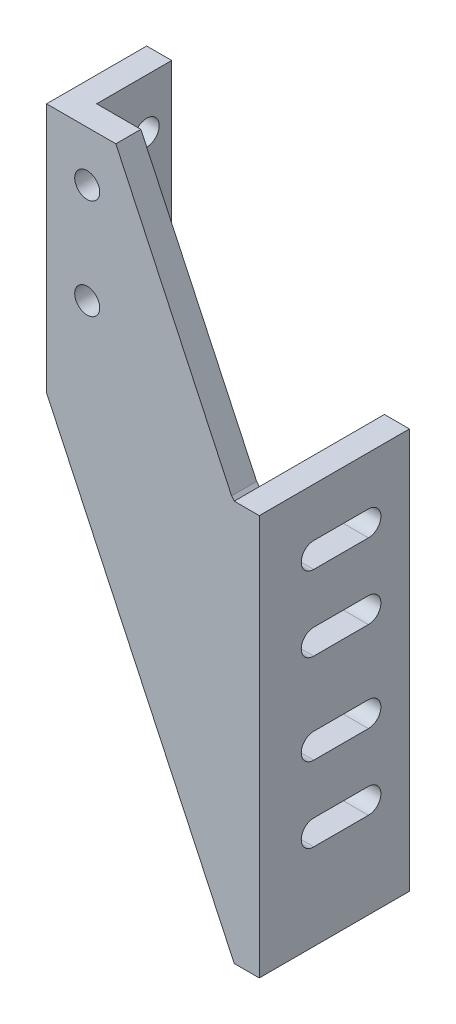
ISO-10303-21;
HEADER;
FILE_DESCRIPTION(('STEP AP214'),'2;1');
FILE_NAME('part.step','',(''),(''),'','','');
FILE_SCHEMA(('AUTOMOTIVE_DESIGN { 1 0 10303 214 1 1 1 1 }'));
ENDSEC;
DATA;
#1=APPLICATION_CONTEXT('core data for automotive mechanical design processes');
#2=APPLICATION_PROTOCOL_DEFINITION('international standard','automotive_design',2000,#1);
#3=PRODUCT_CONTEXT('',#1,'mechanical');
#4=PRODUCT('Part','Part','',(#3));
#5=PRODUCT_RELATED_PRODUCT_CATEGORY('part','',(#4));
#6=PRODUCT_DEFINITION_FORMATION('','',#4);
#7=PRODUCT_DEFINITION_CONTEXT('part definition',#1,'design');
#8=PRODUCT_DEFINITION('design','',#6,#7);
#9=PRODUCT_DEFINITION_SHAPE('','',#8);
#10=(LENGTH_UNIT() NAMED_UNIT(*) SI_UNIT(.MILLI.,.METRE.));
#11=(NAMED_UNIT(*) PLANE_ANGLE_UNIT() SI_UNIT($,.RADIAN.));
#12=(NAMED_UNIT(*) SI_UNIT($,.STERADIAN.) SOLID_ANGLE_UNIT());
#13=UNCERTAINTY_MEASURE_WITH_UNIT(LENGTH_MEASURE(1.E-05),#10,'distance_accuracy_value','');
#14=(GEOMETRIC_REPRESENTATION_CONTEXT(3) GLOBAL_UNCERTAINTY_ASSIGNED_CONTEXT((#13)) GLOBAL_UNIT_ASSIGNED_CONTEXT((#10,
#11,#12)) REPRESENTATION_CONTEXT('',''));
#15=CARTESIAN_POINT('',(0.,0.,0.));
#16=DIRECTION('',(0.,0.,1.));
#17=DIRECTION('',(1.,0.,0.));
#18=AXIS2_PLACEMENT_3D('',#15,#16,#17);
#19=CARTESIAN_POINT('',(-106.588300915185,-1.66039880784868,12.7));
#20=DIRECTION('',(0.,0.,1.));
#21=DIRECTION('',(1.,0.,0.));
#22=AXIS2_PLACEMENT_3D('',#19,#20,#21);
#23=PLANE('',#22);
#24=CARTESIAN_POINT('',(-85.963500915185,49.1476380283201,12.7));
#25=DIRECTION('',(0.,0.,-1.));
#26=DIRECTION('',(-1.,0.,0.));
#27=AXIS2_PLACEMENT_3D('',#24,#25,#26);
#28=CIRCLE('',#27,6.34999999999999);
#29=CARTESIAN_POINT('',(-92.313500915185,49.1476380283201,12.7));
#30=VERTEX_POINT('',#29);
#31=EDGE_CURVE('E364',#30,#30,#28,.T.);
#32=ORIENTED_EDGE('',*,*,#31,.T.);
#33=EDGE_LOOP('',(#32));
#34=FACE_BOUND('',#33,.T.);
#35=DIRECTION('',(-1.,0.,0.));
#36=VECTOR('',#35,1.);
#37=CARTESIAN_POINT('',(1.34455174017202,-1.66039880784868,12.7));
#38=LINE('',#37,#36);
#39=CARTESIAN_POINT('',(1.34455174017202,-1.66039880784868,12.7));
#40=VERTEX_POINT('',#39);
#41=CARTESIAN_POINT('',(-11.355448259828,-1.66039880784869,12.7));
#42=VERTEX_POINT('',#41);
#43=EDGE_CURVE('E433',#40,#42,#38,.T.);
#44=ORIENTED_EDGE('',*,*,#43,.T.);
#45=DIRECTION('',(-0.62931680009807,0.77714886933864,0.));
#46=VECTOR('',#45,1.);
#47=CARTESIAN_POINT('',(-11.355448259828,-1.66039880784869,12.7));
#48=LINE('',#47,#46);
#49=CARTESIAN_POINT('',(-12.7,0.,12.7));
#50=VERTEX_POINT('',#49);
#51=EDGE_CURVE('E436',#42,#50,#48,.T.);
#52=ORIENTED_EDGE('',*,*,#51,.T.);
#53=DIRECTION('',(-0.424357467855125,0.905494748452793,0.));
#54=VECTOR('',#53,1.);
#55=CARTESIAN_POINT('',(-12.7,0.,12.7));
#56=LINE('',#55,#54);
#57=CARTESIAN_POINT('',(-71.443804275185,125.34763802832,12.7));
#58=VERTEX_POINT('',#57);
#59=EDGE_CURVE('E439',#50,#58,#56,.T.);
#60=ORIENTED_EDGE('',*,*,#59,.T.);
#61=DIRECTION('',(-1.,0.,0.));
#62=VECTOR('',#61,1.);
#63=CARTESIAN_POINT('',(-71.443804275185,125.34763802832,12.7));
#64=LINE('',#63,#62);
#65=CARTESIAN_POINT('',(-106.588300915185,125.34763802832,12.7));
#66=VERTEX_POINT('',#65);
#67=EDGE_CURVE('E441',#58,#66,#64,.T.);
#68=ORIENTED_EDGE('',*,*,#67,.T.);
#69=DIRECTION('',(0.,-1.,0.));
#70=VECTOR('',#69,1.);
#71=CARTESIAN_POINT('',(-106.588300915185,125.34763802832,12.7));
#72=LINE('',#71,#70);
#73=CARTESIAN_POINT('',(-106.588300915185,-1.65236197167989,12.7));
#74=VERTEX_POINT('',#73);
#75=EDGE_CURVE('E443',#66,#74,#72,.T.);
#76=ORIENTED_EDGE('',*,*,#75,.T.);
#77=DIRECTION('',(0.424357467855112,-0.905494748452799,0.));
#78=VECTOR('',#77,1.);
#79=CARTESIAN_POINT('',(-106.588300915185,-1.65236197167989,12.7));
#80=LINE('',#79,#78);
#81=CARTESIAN_POINT('',(-11.355448259828,-204.860398807849,12.7));
#82=VERTEX_POINT('',#81);
#83=EDGE_CURVE('E445',#74,#82,#80,.T.);
#84=ORIENTED_EDGE('',*,*,#83,.T.);
#85=DIRECTION('',(1.,0.,0.));
#86=VECTOR('',#85,1.);
#87=CARTESIAN_POINT('',(-11.355448259828,-204.860398807849,12.7));
#88=LINE('',#87,#86);
#89=CARTESIAN_POINT('',(1.34455174017202,-204.860398807849,12.7));
#90=VERTEX_POINT('',#89);
#91=EDGE_CURVE('E447',#82,#90,#88,.T.);
#92=ORIENTED_EDGE('',*,*,#91,.T.);
#93=DIRECTION('',(0.,1.,0.));
#94=VECTOR('',#93,1.);
#95=CARTESIAN_POINT('',(1.34455174017202,-204.860398807849,12.7));
#96=LINE('',#95,#94);
#97=EDGE_CURVE('E449',#90,#40,#96,.T.);
#98=ORIENTED_EDGE('',*,*,#97,.T.);
#99=EDGE_LOOP('',(#44,#52,#60,#68,#76,#84,#92,#98));
#100=FACE_BOUND('',#99,.T.);
#101=CARTESIAN_POINT('',(-85.963500915185,99.9476380283201,12.7));
#102=DIRECTION('',(0.,0.,-1.));
#103=DIRECTION('',(-1.,0.,0.));
#104=AXIS2_PLACEMENT_3D('',#101,#102,#103);
#105=CIRCLE('',#104,6.34999999999999);
#106=CARTESIAN_POINT('',(-92.313500915185,99.9476380283201,12.7));
#107=VERTEX_POINT('',#106);
#108=EDGE_CURVE('E358',#107,#107,#105,.T.);
#109=ORIENTED_EDGE('',*,*,#108,.T.);
#110=EDGE_LOOP('',(#109));
#111=FACE_BOUND('',#110,.T.);
#112=ADVANCED_FACE('F44',(#34,#100,#111),#23,.T.);
#113=CARTESIAN_POINT('',(-106.588300915185,-1.66039880784868,0.));
#114=DIRECTION('',(0.,0.,1.));
#115=DIRECTION('',(1.,0.,0.));
#116=AXIS2_PLACEMENT_3D('',#113,#114,#115);
#117=PLANE('',#116);
#118=CARTESIAN_POINT('',(-85.963500915185,49.1476380283201,0.));
#119=DIRECTION('',(0.,0.,-1.));
#120=DIRECTION('',(-1.,0.,0.));
#121=AXIS2_PLACEMENT_3D('',#118,#119,#120);
#122=CIRCLE('',#121,6.34999999999999);
#123=CARTESIAN_POINT('',(-92.313500915185,49.1476380283201,0.));
#124=VERTEX_POINT('',#123);
#125=EDGE_CURVE('E367',#124,#124,#122,.T.);
#126=ORIENTED_EDGE('',*,*,#125,.F.);
#127=EDGE_LOOP('',(#126));
#128=FACE_BOUND('',#127,.T.);
#129=DIRECTION('',(-0.62931680009807,0.77714886933864,0.));
#130=VECTOR('',#129,1.);
#131=CARTESIAN_POINT('',(-11.355448259828,-1.66039880784869,0.));
#132=LINE('',#131,#130);
#133=CARTESIAN_POINT('',(-11.355448259828,-1.66039880784869,0.));
#134=VERTEX_POINT('',#133);
#135=CARTESIAN_POINT('',(-12.7,0.,0.));
#136=VERTEX_POINT('',#135);
#137=EDGE_CURVE('E423',#134,#136,#132,.T.);
#138=ORIENTED_EDGE('',*,*,#137,.F.);
#139=DIRECTION('',(0.,-1.,0.));
#140=VECTOR('',#139,1.);
#141=CARTESIAN_POINT('',(-11.355448259828,-204.860398807849,0.));
#142=LINE('',#141,#140);
#143=CARTESIAN_POINT('',(-11.355448259828,-204.860398807849,0.));
#144=VERTEX_POINT('',#143);
#145=EDGE_CURVE('E376',#134,#144,#142,.T.);
#146=ORIENTED_EDGE('',*,*,#145,.T.);
#147=DIRECTION('',(0.424357467855112,-0.905494748452799,0.));
#148=VECTOR('',#147,1.);
#149=CARTESIAN_POINT('',(-106.588300915185,-1.65236197167989,0.));
#150=LINE('',#149,#148);
#151=CARTESIAN_POINT('',(-106.588300915185,-1.65236197167989,0.));
#152=VERTEX_POINT('',#151);
#153=EDGE_CURVE('E437',#152,#144,#150,.T.);
#154=ORIENTED_EDGE('',*,*,#153,.F.);
#155=DIRECTION('',(1.,0.,0.));
#156=VECTOR('',#155,1.);
#157=CARTESIAN_POINT('',(-106.588300915185,-1.65236197167989,0.));
#158=LINE('',#157,#156);
#159=CARTESIAN_POINT('',(-93.888300915185,-1.65236197167989,0.));
#160=VERTEX_POINT('',#159);
#161=EDGE_CURVE('E394',#152,#160,#158,.T.);
#162=ORIENTED_EDGE('',*,*,#161,.T.);
#163=DIRECTION('',(0.,1.,0.));
#164=VECTOR('',#163,1.);
#165=CARTESIAN_POINT('',(-93.888300915185,125.34763802832,0.));
#166=LINE('',#165,#164);
#167=CARTESIAN_POINT('',(-93.888300915185,125.34763802832,0.));
#168=VERTEX_POINT('',#167);
#169=EDGE_CURVE('E401',#160,#168,#166,.T.);
#170=ORIENTED_EDGE('',*,*,#169,.T.);
#171=DIRECTION('',(-1.,0.,0.));
#172=VECTOR('',#171,1.);
#173=CARTESIAN_POINT('',(-71.443804275185,125.34763802832,0.));
#174=LINE('',#173,#172);
#175=CARTESIAN_POINT('',(-71.443804275185,125.34763802832,0.));
#176=VERTEX_POINT('',#175);
#177=EDGE_CURVE('E420',#176,#168,#174,.T.);
#178=ORIENTED_EDGE('',*,*,#177,.F.);
#179=DIRECTION('',(-0.424357467855125,0.905494748452793,0.));
#180=VECTOR('',#179,1.);
#181=CARTESIAN_POINT('',(-12.7,0.,0.));
#182=LINE('',#181,#180);
#183=EDGE_CURVE('E426',#136,#176,#182,.T.);
#184=ORIENTED_EDGE('',*,*,#183,.F.);
#185=EDGE_LOOP('',(#138,#146,#154,#162,#170,#178,#184));
#186=FACE_BOUND('',#185,.T.);
#187=CARTESIAN_POINT('',(-85.963500915185,99.9476380283201,0.));
#188=DIRECTION('',(0.,0.,-1.));
#189=DIRECTION('',(-1.,0.,0.));
#190=AXIS2_PLACEMENT_3D('',#187,#188,#189);
#191=CIRCLE('',#190,6.34999999999999);
#192=CARTESIAN_POINT('',(-92.313500915185,99.9476380283201,0.));
#193=VERTEX_POINT('',#192);
#194=EDGE_CURVE('E361',#193,#193,#191,.T.);
#195=ORIENTED_EDGE('',*,*,#194,.F.);
#196=EDGE_LOOP('',(#195));
#197=FACE_BOUND('',#196,.T.);
#198=ADVANCED_FACE('F481',(#128,#186,#197),#117,.F.);
#199=CARTESIAN_POINT('',(1.34455174017202,-1.66039880784868,12.7));
#200=DIRECTION('',(0.,-1.,0.));
#201=DIRECTION('',(1.,0.,0.));
#202=AXIS2_PLACEMENT_3D('',#199,#200,#201);
#203=PLANE('',#202);
#204=DIRECTION('',(0.,0.,-1.));
#205=VECTOR('',#204,1.);
#206=CARTESIAN_POINT('',(1.34455174017202,-1.66039880784868,12.7));
#207=LINE('',#206,#205);
#208=CARTESIAN_POINT('',(1.34455174017202,-1.66039880784869,-63.5));
#209=VERTEX_POINT('',#208);
#210=EDGE_CURVE('E450',#40,#209,#207,.T.);
#211=ORIENTED_EDGE('',*,*,#210,.T.);
#212=DIRECTION('',(-1.,0.,0.));
#213=VECTOR('',#212,1.);
#214=CARTESIAN_POINT('',(1.34455174017202,-1.66039880784869,-63.5));
#215=LINE('',#214,#213);
#216=CARTESIAN_POINT('',(-11.355448259828,-1.66039880784869,-63.5));
#217=VERTEX_POINT('',#216);
#218=EDGE_CURVE('E380',#209,#217,#215,.T.);
#219=ORIENTED_EDGE('',*,*,#218,.T.);
#220=DIRECTION('',(0.,0.,1.));
#221=VECTOR('',#220,1.);
#222=CARTESIAN_POINT('',(-11.355448259828,-1.66039880784869,-63.5));
#223=LINE('',#222,#221);
#224=EDGE_CURVE('E389',#217,#134,#223,.T.);
#225=ORIENTED_EDGE('',*,*,#224,.T.);
#226=DIRECTION('',(0.,0.,-1.));
#227=VECTOR('',#226,1.);
#228=CARTESIAN_POINT('',(-11.355448259828,-1.66039880784869,12.7));
#229=LINE('',#228,#227);
#230=EDGE_CURVE('E13',#42,#134,#229,.T.);
#231=ORIENTED_EDGE('',*,*,#230,.F.);
#232=ORIENTED_EDGE('',*,*,#43,.F.);
#233=EDGE_LOOP('',(#211,#219,#225,#231,#232));
#234=FACE_BOUND('',#233,.T.);
#235=ADVANCED_FACE('F46',(#234),#203,.F.);
#236=CARTESIAN_POINT('',(-11.355448259828,-1.66039880784869,12.7));
#237=DIRECTION('',(-0.77714886933864,-0.629316800098069,0.));
#238=DIRECTION('',(0.62931680009807,-0.77714886933864,0.));
#239=AXIS2_PLACEMENT_3D('',#236,#237,#238);
#240=PLANE('',#239);
#241=ORIENTED_EDGE('',*,*,#137,.T.);
#242=DIRECTION('',(0.,0.,-1.));
#243=VECTOR('',#242,1.);
#244=CARTESIAN_POINT('',(-12.7,0.,12.7));
#245=LINE('',#244,#243);
#246=EDGE_CURVE('E53',#50,#136,#245,.T.);
#247=ORIENTED_EDGE('',*,*,#246,.F.);
#248=ORIENTED_EDGE('',*,*,#51,.F.);
#249=ORIENTED_EDGE('',*,*,#230,.T.);
#250=EDGE_LOOP('',(#241,#247,#248,#249));
#251=FACE_BOUND('',#250,.T.);
#252=ADVANCED_FACE('F493',(#251),#240,.F.);
#253=CARTESIAN_POINT('',(-12.7,0.,12.7));
#254=DIRECTION('',(-0.905494748452793,-0.424357467855125,0.));
#255=DIRECTION('',(0.424357467855125,-0.905494748452793,0.));
#256=AXIS2_PLACEMENT_3D('',#253,#254,#255);
#257=PLANE('',#256);
#258=ORIENTED_EDGE('',*,*,#183,.T.);
#259=DIRECTION('',(0.,0.,-1.));
#260=VECTOR('',#259,1.);
#261=CARTESIAN_POINT('',(-71.443804275185,125.34763802832,12.7));
#262=LINE('',#261,#260);
#263=EDGE_CURVE('E467',#58,#176,#262,.T.);
#264=ORIENTED_EDGE('',*,*,#263,.F.);
#265=ORIENTED_EDGE('',*,*,#59,.F.);
#266=ORIENTED_EDGE('',*,*,#246,.T.);
#267=EDGE_LOOP('',(#258,#264,#265,#266));
#268=FACE_BOUND('',#267,.T.);
#269=ADVANCED_FACE('F475',(#268),#257,.F.);
#270=CARTESIAN_POINT('',(-71.443804275185,125.34763802832,12.7));
#271=DIRECTION('',(0.,-1.,0.));
#272=DIRECTION('',(0.,0.,-1.));
#273=AXIS2_PLACEMENT_3D('',#270,#271,#272);
#274=PLANE('',#273);
#275=ORIENTED_EDGE('',*,*,#177,.T.);
#276=DIRECTION('',(0.,0.,1.));
#277=VECTOR('',#276,1.);
#278=CARTESIAN_POINT('',(-93.888300915185,125.34763802832,-38.1));
#279=LINE('',#278,#277);
#280=CARTESIAN_POINT('',(-93.888300915185,125.34763802832,-38.1));
#281=VERTEX_POINT('',#280);
#282=EDGE_CURVE('E422',#281,#168,#279,.T.);
#283=ORIENTED_EDGE('',*,*,#282,.F.);
#284=DIRECTION('',(-1.,0.,0.));
#285=VECTOR('',#284,1.);
#286=CARTESIAN_POINT('',(-106.588300915185,125.34763802832,-38.1));
#287=LINE('',#286,#285);
#288=CARTESIAN_POINT('',(-106.588300915185,125.34763802832,-38.1));
#289=VERTEX_POINT('',#288);
#290=EDGE_CURVE('E407',#281,#289,#287,.T.);
#291=ORIENTED_EDGE('',*,*,#290,.T.);
#292=DIRECTION('',(0.,0.,-1.));
#293=VECTOR('',#292,1.);
#294=CARTESIAN_POINT('',(-106.588300915185,125.34763802832,12.7));
#295=LINE('',#294,#293);
#296=EDGE_CURVE('E465',#66,#289,#295,.T.);
#297=ORIENTED_EDGE('',*,*,#296,.F.);
#298=ORIENTED_EDGE('',*,*,#67,.F.);
#299=ORIENTED_EDGE('',*,*,#263,.T.);
#300=EDGE_LOOP('',(#275,#283,#291,#297,#298,#299));
#301=FACE_BOUND('',#300,.T.);
#302=ADVANCED_FACE('F485',(#301),#274,.F.);
#303=CARTESIAN_POINT('',(-106.588300915185,125.34763802832,12.7));
#304=DIRECTION('',(1.,0.,0.));
#305=DIRECTION('',(0.,1.,0.));
#306=AXIS2_PLACEMENT_3D('',#303,#304,#305);
#307=PLANE('',#306);
#308=CARTESIAN_POINT('',(-106.588300915185,99.9476380283201,-25.4));
#309=DIRECTION('',(-1.,0.,0.));
#310=DIRECTION('',(0.,0.,1.));
#311=AXIS2_PLACEMENT_3D('',#308,#309,#310);
#312=CIRCLE('',#311,6.34999999999999);
#313=CARTESIAN_POINT('',(-106.588300915185,99.9476380283201,-19.05));
#314=VERTEX_POINT('',#313);
#315=EDGE_CURVE('E370',#314,#314,#312,.T.);
#316=ORIENTED_EDGE('',*,*,#315,.F.);
#317=EDGE_LOOP('',(#316));
#318=FACE_BOUND('',#317,.T.);
#319=ORIENTED_EDGE('',*,*,#296,.T.);
#320=DIRECTION('',(0.,-1.,0.));
#321=VECTOR('',#320,1.);
#322=CARTESIAN_POINT('',(-106.588300915185,125.34763802832,-38.1));
#323=LINE('',#322,#321);
#324=CARTESIAN_POINT('',(-106.588300915185,-1.65236197167989,-38.1));
#325=VERTEX_POINT('',#324);
#326=EDGE_CURVE('E397',#289,#325,#323,.T.);
#327=ORIENTED_EDGE('',*,*,#326,.T.);
#328=DIRECTION('',(0.,0.,1.));
#329=VECTOR('',#328,1.);
#330=CARTESIAN_POINT('',(-106.588300915185,-1.65236197167989,-38.1));
#331=LINE('',#330,#329);
#332=EDGE_CURVE('E410',#325,#152,#331,.T.);
#333=ORIENTED_EDGE('',*,*,#332,.T.);
#334=DIRECTION('',(0.,0.,-1.));
#335=VECTOR('',#334,1.);
#336=CARTESIAN_POINT('',(-106.588300915185,-1.65236197167989,12.7));
#337=LINE('',#336,#335);
#338=EDGE_CURVE('E462',#74,#152,#337,.T.);
#339=ORIENTED_EDGE('',*,*,#338,.F.);
#340=ORIENTED_EDGE('',*,*,#75,.F.);
#341=EDGE_LOOP('',(#319,#327,#333,#339,#340));
#342=FACE_BOUND('',#341,.T.);
#343=ADVANCED_FACE('F512',(#318,#342),#307,.F.);
#344=CARTESIAN_POINT('',(-106.588300915185,-1.65236197167989,12.7));
#345=DIRECTION('',(0.905494748452799,0.424357467855112,0.));
#346=DIRECTION('',(-0.424357467855112,0.905494748452799,0.));
#347=AXIS2_PLACEMENT_3D('',#344,#345,#346);
#348=PLANE('',#347);
#349=ORIENTED_EDGE('',*,*,#153,.T.);
#350=DIRECTION('',(0.,0.,-1.));
#351=VECTOR('',#350,1.);
#352=CARTESIAN_POINT('',(-11.355448259828,-204.860398807849,12.7));
#353=LINE('',#352,#351);
#354=EDGE_CURVE('E459',#82,#144,#353,.T.);
#355=ORIENTED_EDGE('',*,*,#354,.F.);
#356=ORIENTED_EDGE('',*,*,#83,.F.);
#357=ORIENTED_EDGE('',*,*,#338,.T.);
#358=EDGE_LOOP('',(#349,#355,#356,#357));
#359=FACE_BOUND('',#358,.T.);
#360=ADVANCED_FACE('F510',(#359),#348,.F.);
#361=CARTESIAN_POINT('',(-11.355448259828,-204.860398807849,12.7));
#362=DIRECTION('',(0.,1.,0.));
#363=DIRECTION('',(0.,0.,1.));
#364=AXIS2_PLACEMENT_3D('',#361,#362,#363);
#365=PLANE('',#364);
#366=ORIENTED_EDGE('',*,*,#354,.T.);
#367=DIRECTION('',(0.,0.,1.));
#368=VECTOR('',#367,1.);
#369=CARTESIAN_POINT('',(-11.355448259828,-204.860398807849,-63.5));
#370=LINE('',#369,#368);
#371=CARTESIAN_POINT('',(-11.355448259828,-204.860398807849,-63.5));
#372=VERTEX_POINT('',#371);
#373=EDGE_CURVE('E392',#372,#144,#370,.T.);
#374=ORIENTED_EDGE('',*,*,#373,.F.);
#375=DIRECTION('',(1.,0.,0.));
#376=VECTOR('',#375,1.);
#377=CARTESIAN_POINT('',(1.34455174017202,-204.860398807849,-63.5));
#378=LINE('',#377,#376);
#379=CARTESIAN_POINT('',(1.34455174017202,-204.860398807849,-63.5));
#380=VERTEX_POINT('',#379);
#381=EDGE_CURVE('E386',#372,#380,#378,.T.);
#382=ORIENTED_EDGE('',*,*,#381,.T.);
#383=DIRECTION('',(0.,0.,-1.));
#384=VECTOR('',#383,1.);
#385=CARTESIAN_POINT('',(1.34455174017202,-204.860398807849,12.7));
#386=LINE('',#385,#384);
#387=EDGE_CURVE('E457',#90,#380,#386,.T.);
#388=ORIENTED_EDGE('',*,*,#387,.F.);
#389=ORIENTED_EDGE('',*,*,#91,.F.);
#390=EDGE_LOOP('',(#366,#374,#382,#388,#389));
#391=FACE_BOUND('',#390,.T.);
#392=ADVANCED_FACE('F504',(#391),#365,.F.);
#393=CARTESIAN_POINT('',(1.34455174017202,-204.860398807849,12.7));
#394=DIRECTION('',(-1.,0.,0.));
#395=DIRECTION('',(0.,0.,1.));
#396=AXIS2_PLACEMENT_3D('',#393,#394,#395);
#397=PLANE('',#396);
#398=DIRECTION('',(0.,0.,-1.));
#399=VECTOR('',#398,1.);
#400=CARTESIAN_POINT('',(1.34455174017202,-122.945398807849,-42.672));
#401=LINE('',#400,#399);
#402=CARTESIAN_POINT('',(1.34455174017202,-122.945398807849,-14.945063582));
#403=VERTEX_POINT('',#402);
#404=CARTESIAN_POINT('',(1.34455174017202,-122.945398807849,-42.672));
#405=VERTEX_POINT('',#404);
#406=EDGE_CURVE('E247',#403,#405,#401,.T.);
#407=ORIENTED_EDGE('',*,*,#406,.F.);
#408=CARTESIAN_POINT('',(1.34455174017202,-116.595398807849,-14.945063582));
#409=DIRECTION('',(1.,0.,0.));
#410=DIRECTION('',(0.,0.,-1.));
#411=AXIS2_PLACEMENT_3D('',#408,#409,#410);
#412=CIRCLE('',#411,6.35);
#413=CARTESIAN_POINT('',(1.34455174017202,-110.245398807849,-14.945063582));
#414=VERTEX_POINT('',#413);
#415=EDGE_CURVE('E61',#414,#403,#412,.T.);
#416=ORIENTED_EDGE('',*,*,#415,.F.);
#417=DIRECTION('',(0.,0.,1.));
#418=VECTOR('',#417,1.);
#419=CARTESIAN_POINT('',(1.34455174017202,-110.245398807849,-14.945063582));
#420=LINE('',#419,#418);
#421=CARTESIAN_POINT('',(1.34455174017202,-110.245398807849,-42.672));
#422=VERTEX_POINT('',#421);
#423=EDGE_CURVE('E240',#422,#414,#420,.T.);
#424=ORIENTED_EDGE('',*,*,#423,.F.);
#425=CARTESIAN_POINT('',(1.34455174017202,-116.595398807849,-42.672));
#426=DIRECTION('',(1.,0.,0.));
#427=DIRECTION('',(0.,0.,-1.));
#428=AXIS2_PLACEMENT_3D('',#425,#426,#427);
#429=CIRCLE('',#428,6.34999999999999);
#430=EDGE_CURVE('E254',#405,#422,#429,.T.);
#431=ORIENTED_EDGE('',*,*,#430,.F.);
#432=EDGE_LOOP('',(#407,#416,#424,#431));
#433=FACE_BOUND('',#432,.T.);
#434=DIRECTION('',(0.,0.,-1.));
#435=VECTOR('',#434,1.);
#436=CARTESIAN_POINT('',(1.34455174017202,-161.045398807849,-42.672));
#437=LINE('',#436,#435);
#438=CARTESIAN_POINT('',(1.34455174017202,-161.045398807849,-14.945063582));
#439=VERTEX_POINT('',#438);
#440=CARTESIAN_POINT('',(1.34455174017202,-161.045398807849,-42.672));
#441=VERTEX_POINT('',#440);
#442=EDGE_CURVE('E273',#439,#441,#437,.T.);
#443=ORIENTED_EDGE('',*,*,#442,.F.);
#444=CARTESIAN_POINT('',(1.34455174017202,-154.695398807849,-14.945063582));
#445=DIRECTION('',(1.,0.,0.));
#446=DIRECTION('',(0.,0.,-1.));
#447=AXIS2_PLACEMENT_3D('',#444,#445,#446);
#448=CIRCLE('',#447,6.35000000000001);
#449=CARTESIAN_POINT('',(1.34455174017202,-148.345398807849,-14.945063582));
#450=VERTEX_POINT('',#449);
#451=EDGE_CURVE('E271',#450,#439,#448,.T.);
#452=ORIENTED_EDGE('',*,*,#451,.F.);
#453=DIRECTION('',(0.,0.,1.));
#454=VECTOR('',#453,1.);
#455=CARTESIAN_POINT('',(1.34455174017202,-148.345398807849,-14.945063582));
#456=LINE('',#455,#454);
#457=CARTESIAN_POINT('',(1.34455174017202,-148.345398807849,-42.672));
#458=VERTEX_POINT('',#457);
#459=EDGE_CURVE('E279',#458,#450,#456,.T.);
#460=ORIENTED_EDGE('',*,*,#459,.F.);
#461=CARTESIAN_POINT('',(1.34455174017202,-154.695398807849,-42.672));
#462=DIRECTION('',(1.,0.,0.));
#463=DIRECTION('',(0.,0.,-1.));
#464=AXIS2_PLACEMENT_3D('',#461,#462,#463);
#465=CIRCLE('',#464,6.34999999999999);
#466=EDGE_CURVE('E276',#441,#458,#465,.T.);
#467=ORIENTED_EDGE('',*,*,#466,.F.);
#468=EDGE_LOOP('',(#443,#452,#460,#467));
#469=FACE_BOUND('',#468,.T.);
#470=DIRECTION('',(0.,0.,-1.));
#471=VECTOR('',#470,1.);
#472=CARTESIAN_POINT('',(1.34455174017202,-39.1253988078487,-42.672));
#473=LINE('',#472,#471);
#474=CARTESIAN_POINT('',(1.34455174017202,-39.1253988078487,-14.945063582));
#475=VERTEX_POINT('',#474);
#476=CARTESIAN_POINT('',(1.34455174017202,-39.1253988078487,-42.672));
#477=VERTEX_POINT('',#476);
#478=EDGE_CURVE('E305',#475,#477,#473,.T.);
#479=ORIENTED_EDGE('',*,*,#478,.F.);
#480=CARTESIAN_POINT('',(1.34455174017202,-32.7753988078487,-14.945063582));
#481=DIRECTION('',(1.,0.,0.));
#482=DIRECTION('',(0.,0.,-1.));
#483=AXIS2_PLACEMENT_3D('',#480,#481,#482);
#484=CIRCLE('',#483,6.35);
#485=CARTESIAN_POINT('',(1.34455174017202,-26.4253988078487,-14.945063582));
#486=VERTEX_POINT('',#485);
#487=EDGE_CURVE('E303',#486,#475,#484,.T.);
#488=ORIENTED_EDGE('',*,*,#487,.F.);
#489=DIRECTION('',(0.,0.,1.));
#490=VECTOR('',#489,1.);
#491=CARTESIAN_POINT('',(1.34455174017202,-26.4253988078487,-14.945063582));
#492=LINE('',#491,#490);
#493=CARTESIAN_POINT('',(1.34455174017202,-26.4253988078487,-42.672));
#494=VERTEX_POINT('',#493);
#495=EDGE_CURVE('E311',#494,#486,#492,.T.);
#496=ORIENTED_EDGE('',*,*,#495,.F.);
#497=CARTESIAN_POINT('',(1.34455174017202,-32.7753988078487,-42.672));
#498=DIRECTION('',(1.,0.,0.));
#499=DIRECTION('',(0.,0.,-1.));
#500=AXIS2_PLACEMENT_3D('',#497,#498,#499);
#501=CIRCLE('',#500,6.35);
#502=EDGE_CURVE('E308',#477,#494,#501,.T.);
#503=ORIENTED_EDGE('',*,*,#502,.F.);
#504=EDGE_LOOP('',(#479,#488,#496,#503));
#505=FACE_BOUND('',#504,.T.);
#506=DIRECTION('',(0.,0.,-1.));
#507=VECTOR('',#506,1.);
#508=CARTESIAN_POINT('',(1.34455174017202,-77.2253988078487,-42.672));
#509=LINE('',#508,#507);
#510=CARTESIAN_POINT('',(1.34455174017202,-77.2253988078487,-14.945063582));
#511=VERTEX_POINT('',#510);
#512=CARTESIAN_POINT('',(1.34455174017202,-77.2253988078487,-42.672));
#513=VERTEX_POINT('',#512);
#514=EDGE_CURVE('E337',#511,#513,#509,.T.);
#515=ORIENTED_EDGE('',*,*,#514,.F.);
#516=CARTESIAN_POINT('',(1.34455174017202,-70.8753988078487,-14.945063582));
#517=DIRECTION('',(1.,0.,0.));
#518=DIRECTION('',(0.,0.,-1.));
#519=AXIS2_PLACEMENT_3D('',#516,#517,#518);
#520=CIRCLE('',#519,6.35);
#521=CARTESIAN_POINT('',(1.34455174017202,-64.5253988078487,-14.945063582));
#522=VERTEX_POINT('',#521);
#523=EDGE_CURVE('E335',#522,#511,#520,.T.);
#524=ORIENTED_EDGE('',*,*,#523,.F.);
#525=DIRECTION('',(0.,0.,1.));
#526=VECTOR('',#525,1.);
#527=CARTESIAN_POINT('',(1.34455174017202,-64.5253988078487,-14.945063582));
#528=LINE('',#527,#526);
#529=CARTESIAN_POINT('',(1.34455174017202,-64.5253988078487,-42.672));
#530=VERTEX_POINT('',#529);
#531=EDGE_CURVE('E343',#530,#522,#528,.T.);
#532=ORIENTED_EDGE('',*,*,#531,.F.);
#533=CARTESIAN_POINT('',(1.34455174017202,-70.8753988078487,-42.672));
#534=DIRECTION('',(1.,0.,0.));
#535=DIRECTION('',(0.,0.,-1.));
#536=AXIS2_PLACEMENT_3D('',#533,#534,#535);
#537=CIRCLE('',#536,6.34999999999999);
#538=EDGE_CURVE('E340',#513,#530,#537,.T.);
#539=ORIENTED_EDGE('',*,*,#538,.F.);
#540=EDGE_LOOP('',(#515,#524,#532,#539));
#541=FACE_BOUND('',#540,.T.);
#542=ORIENTED_EDGE('',*,*,#387,.T.);
#543=DIRECTION('',(0.,1.,0.));
#544=VECTOR('',#543,1.);
#545=CARTESIAN_POINT('',(1.34455174017202,-204.860398807849,-63.5));
#546=LINE('',#545,#544);
#547=EDGE_CURVE('E377',#380,#209,#546,.T.);
#548=ORIENTED_EDGE('',*,*,#547,.T.);
#549=ORIENTED_EDGE('',*,*,#210,.F.);
#550=ORIENTED_EDGE('',*,*,#97,.F.);
#551=EDGE_LOOP('',(#542,#548,#549,#550));
#552=FACE_BOUND('',#551,.T.);
#553=ADVANCED_FACE('F528',(#433,#469,#505,#541,#552),#397,.F.);
#554=CARTESIAN_POINT('',(-93.888300915185,125.34763802832,-38.1));
#555=DIRECTION('',(1.,0.,0.));
#556=DIRECTION('',(0.,1.,0.));
#557=AXIS2_PLACEMENT_3D('',#554,#555,#556);
#558=PLANE('',#557);
#559=CARTESIAN_POINT('',(-93.888300915185,99.9476380283201,-25.4));
#560=DIRECTION('',(1.,0.,0.));
#561=DIRECTION('',(0.,1.,0.));
#562=AXIS2_PLACEMENT_3D('',#559,#560,#561);
#563=CIRCLE('',#562,6.34999999999998);
#564=CARTESIAN_POINT('',(-93.888300915185,106.29763802832,-25.4));
#565=VERTEX_POINT('',#564);
#566=EDGE_CURVE('E373',#565,#565,#563,.T.);
#567=ORIENTED_EDGE('',*,*,#566,.F.);
#568=EDGE_LOOP('',(#567));
#569=FACE_BOUND('',#568,.T.);
#570=ORIENTED_EDGE('',*,*,#169,.F.);
#571=DIRECTION('',(0.,0.,1.));
#572=VECTOR('',#571,1.);
#573=CARTESIAN_POINT('',(-93.888300915185,-1.65236197167989,-38.1));
#574=LINE('',#573,#572);
#575=CARTESIAN_POINT('',(-93.888300915185,-1.65236197167989,-38.1));
#576=VERTEX_POINT('',#575);
#577=EDGE_CURVE('E415',#576,#160,#574,.T.);
#578=ORIENTED_EDGE('',*,*,#577,.F.);
#579=DIRECTION('',(0.,1.,0.));
#580=VECTOR('',#579,1.);
#581=CARTESIAN_POINT('',(-93.888300915185,125.34763802832,-38.1));
#582=LINE('',#581,#580);
#583=EDGE_CURVE('E404',#576,#281,#582,.T.);
#584=ORIENTED_EDGE('',*,*,#583,.T.);
#585=ORIENTED_EDGE('',*,*,#282,.T.);
#586=EDGE_LOOP('',(#570,#578,#584,#585));
#587=FACE_BOUND('',#586,.T.);
#588=ADVANCED_FACE('F521',(#569,#587),#558,.T.);
#589=CARTESIAN_POINT('',(-106.588300915185,-1.65236197167989,-38.1));
#590=DIRECTION('',(0.,-1.,0.));
#591=DIRECTION('',(0.,0.,-1.));
#592=AXIS2_PLACEMENT_3D('',#589,#590,#591);
#593=PLANE('',#592);
#594=ORIENTED_EDGE('',*,*,#161,.F.);
#595=ORIENTED_EDGE('',*,*,#332,.F.);
#596=DIRECTION('',(1.,0.,0.));
#597=VECTOR('',#596,1.);
#598=CARTESIAN_POINT('',(-106.588300915185,-1.65236197167989,-38.1));
#599=LINE('',#598,#597);
#600=EDGE_CURVE('E400',#325,#576,#599,.T.);
#601=ORIENTED_EDGE('',*,*,#600,.T.);
#602=ORIENTED_EDGE('',*,*,#577,.T.);
#603=EDGE_LOOP('',(#594,#595,#601,#602));
#604=FACE_BOUND('',#603,.T.);
#605=ADVANCED_FACE('F519',(#604),#593,.T.);
#606=CARTESIAN_POINT('',(-106.588300915185,-1.65236197167989,-38.1));
#607=DIRECTION('',(0.,0.,1.));
#608=DIRECTION('',(1.,0.,0.));
#609=AXIS2_PLACEMENT_3D('',#606,#607,#608);
#610=PLANE('',#609);
#611=ORIENTED_EDGE('',*,*,#326,.F.);
#612=ORIENTED_EDGE('',*,*,#290,.F.);
#613=ORIENTED_EDGE('',*,*,#583,.F.);
#614=ORIENTED_EDGE('',*,*,#600,.F.);
#615=EDGE_LOOP('',(#611,#612,#613,#614));
#616=FACE_BOUND('',#615,.T.);
#617=ADVANCED_FACE('F517',(#616),#610,.F.);
#618=CARTESIAN_POINT('',(-11.355448259828,-204.860398807849,-63.5));
#619=DIRECTION('',(-1.,0.,0.));
#620=DIRECTION('',(0.,0.,1.));
#621=AXIS2_PLACEMENT_3D('',#618,#619,#620);
#622=PLANE('',#621);
#623=CARTESIAN_POINT('',(-11.355448259828,-116.595398807849,-14.945063582));
#624=DIRECTION('',(-1.,0.,0.));
#625=DIRECTION('',(0.,0.,1.));
#626=AXIS2_PLACEMENT_3D('',#623,#624,#625);
#627=CIRCLE('',#626,6.35);
#628=CARTESIAN_POINT('',(-11.355448259828,-110.245398807849,-14.945063582));
#629=VERTEX_POINT('',#628);
#630=CARTESIAN_POINT('',(-11.355448259828,-122.945398807849,-14.945063582));
#631=VERTEX_POINT('',#630);
#632=EDGE_CURVE('E238',#629,#631,#627,.F.);
#633=ORIENTED_EDGE('',*,*,#632,.T.);
#634=DIRECTION('',(0.,0.,-1.));
#635=VECTOR('',#634,1.);
#636=CARTESIAN_POINT('',(-11.355448259828,-122.945398807849,-42.672));
#637=LINE('',#636,#635);
#638=CARTESIAN_POINT('',(-11.355448259828,-122.945398807849,-42.672));
#639=VERTEX_POINT('',#638);
#640=EDGE_CURVE('E227',#631,#639,#637,.T.);
#641=ORIENTED_EDGE('',*,*,#640,.T.);
#642=CARTESIAN_POINT('',(-11.355448259828,-116.595398807849,-42.672));
#643=DIRECTION('',(-1.,0.,0.));
#644=DIRECTION('',(0.,0.,1.));
#645=AXIS2_PLACEMENT_3D('',#642,#643,#644);
#646=CIRCLE('',#645,6.34999999999999);
#647=CARTESIAN_POINT('',(-11.355448259828,-110.245398807849,-42.672));
#648=VERTEX_POINT('',#647);
#649=EDGE_CURVE('E249',#639,#648,#646,.F.);
#650=ORIENTED_EDGE('',*,*,#649,.T.);
#651=DIRECTION('',(0.,0.,1.));
#652=VECTOR('',#651,1.);
#653=CARTESIAN_POINT('',(-11.355448259828,-110.245398807849,-14.945063582));
#654=LINE('',#653,#652);
#655=EDGE_CURVE('E245',#648,#629,#654,.T.);
#656=ORIENTED_EDGE('',*,*,#655,.T.);
#657=EDGE_LOOP('',(#633,#641,#650,#656));
#658=FACE_BOUND('',#657,.T.);
#659=CARTESIAN_POINT('',(-11.355448259828,-154.695398807849,-14.945063582));
#660=DIRECTION('',(-1.,0.,0.));
#661=DIRECTION('',(0.,0.,1.));
#662=AXIS2_PLACEMENT_3D('',#659,#660,#661);
#663=CIRCLE('',#662,6.35000000000001);
#664=CARTESIAN_POINT('',(-11.355448259828,-148.345398807849,-14.945063582));
#665=VERTEX_POINT('',#664);
#666=CARTESIAN_POINT('',(-11.355448259828,-161.045398807849,-14.945063582));
#667=VERTEX_POINT('',#666);
#668=EDGE_CURVE('E268',#665,#667,#663,.F.);
#669=ORIENTED_EDGE('',*,*,#668,.T.);
#670=DIRECTION('',(0.,0.,-1.));
#671=VECTOR('',#670,1.);
#672=CARTESIAN_POINT('',(-11.355448259828,-161.045398807849,-42.672));
#673=LINE('',#672,#671);
#674=CARTESIAN_POINT('',(-11.355448259828,-161.045398807849,-42.672));
#675=VERTEX_POINT('',#674);
#676=EDGE_CURVE('E285',#667,#675,#673,.T.);
#677=ORIENTED_EDGE('',*,*,#676,.T.);
#678=CARTESIAN_POINT('',(-11.355448259828,-154.695398807849,-42.672));
#679=DIRECTION('',(-1.,0.,0.));
#680=DIRECTION('',(0.,0.,1.));
#681=AXIS2_PLACEMENT_3D('',#678,#679,#680);
#682=CIRCLE('',#681,6.34999999999999);
#683=CARTESIAN_POINT('',(-11.355448259828,-148.345398807849,-42.672));
#684=VERTEX_POINT('',#683);
#685=EDGE_CURVE('E234',#675,#684,#682,.F.);
#686=ORIENTED_EDGE('',*,*,#685,.T.);
#687=DIRECTION('',(0.,0.,1.));
#688=VECTOR('',#687,1.);
#689=CARTESIAN_POINT('',(-11.355448259828,-148.345398807849,-14.945063582));
#690=LINE('',#689,#688);
#691=EDGE_CURVE('E265',#684,#665,#690,.T.);
#692=ORIENTED_EDGE('',*,*,#691,.T.);
#693=EDGE_LOOP('',(#669,#677,#686,#692));
#694=FACE_BOUND('',#693,.T.);
#695=CARTESIAN_POINT('',(-11.355448259828,-32.7753988078487,-14.945063582));
#696=DIRECTION('',(-1.,0.,0.));
#697=DIRECTION('',(0.,0.,1.));
#698=AXIS2_PLACEMENT_3D('',#695,#696,#697);
#699=CIRCLE('',#698,6.35);
#700=CARTESIAN_POINT('',(-11.355448259828,-26.4253988078487,-14.945063582));
#701=VERTEX_POINT('',#700);
#702=CARTESIAN_POINT('',(-11.355448259828,-39.1253988078487,-14.945063582));
#703=VERTEX_POINT('',#702);
#704=EDGE_CURVE('E300',#701,#703,#699,.F.);
#705=ORIENTED_EDGE('',*,*,#704,.T.);
#706=DIRECTION('',(0.,0.,-1.));
#707=VECTOR('',#706,1.);
#708=CARTESIAN_POINT('',(-11.355448259828,-39.1253988078487,-42.672));
#709=LINE('',#708,#707);
#710=CARTESIAN_POINT('',(-11.355448259828,-39.1253988078487,-42.672));
#711=VERTEX_POINT('',#710);
#712=EDGE_CURVE('E317',#703,#711,#709,.T.);
#713=ORIENTED_EDGE('',*,*,#712,.T.);
#714=CARTESIAN_POINT('',(-11.355448259828,-32.7753988078487,-42.672));
#715=DIRECTION('',(-1.,0.,0.));
#716=DIRECTION('',(0.,0.,1.));
#717=AXIS2_PLACEMENT_3D('',#714,#715,#716);
#718=CIRCLE('',#717,6.35);
#719=CARTESIAN_POINT('',(-11.355448259828,-26.4253988078487,-42.672));
#720=VERTEX_POINT('',#719);
#721=EDGE_CURVE('E294',#711,#720,#718,.F.);
#722=ORIENTED_EDGE('',*,*,#721,.T.);
#723=DIRECTION('',(0.,0.,1.));
#724=VECTOR('',#723,1.);
#725=CARTESIAN_POINT('',(-11.355448259828,-26.4253988078487,-14.945063582));
#726=LINE('',#725,#724);
#727=EDGE_CURVE('E297',#720,#701,#726,.T.);
#728=ORIENTED_EDGE('',*,*,#727,.T.);
#729=EDGE_LOOP('',(#705,#713,#722,#728));
#730=FACE_BOUND('',#729,.T.);
#731=CARTESIAN_POINT('',(-11.355448259828,-70.8753988078487,-14.945063582));
#732=DIRECTION('',(-1.,0.,0.));
#733=DIRECTION('',(0.,0.,1.));
#734=AXIS2_PLACEMENT_3D('',#731,#732,#733);
#735=CIRCLE('',#734,6.35);
#736=CARTESIAN_POINT('',(-11.355448259828,-64.5253988078487,-14.945063582));
#737=VERTEX_POINT('',#736);
#738=CARTESIAN_POINT('',(-11.355448259828,-77.2253988078487,-14.945063582));
#739=VERTEX_POINT('',#738);
#740=EDGE_CURVE('E332',#737,#739,#735,.F.);
#741=ORIENTED_EDGE('',*,*,#740,.T.);
#742=DIRECTION('',(0.,0.,-1.));
#743=VECTOR('',#742,1.);
#744=CARTESIAN_POINT('',(-11.355448259828,-77.2253988078487,-42.672));
#745=LINE('',#744,#743);
#746=CARTESIAN_POINT('',(-11.355448259828,-77.2253988078487,-42.672));
#747=VERTEX_POINT('',#746);
#748=EDGE_CURVE('E349',#739,#747,#745,.T.);
#749=ORIENTED_EDGE('',*,*,#748,.T.);
#750=CARTESIAN_POINT('',(-11.355448259828,-70.8753988078487,-42.672));
#751=DIRECTION('',(-1.,0.,0.));
#752=DIRECTION('',(0.,0.,1.));
#753=AXIS2_PLACEMENT_3D('',#750,#751,#752);
#754=CIRCLE('',#753,6.34999999999999);
#755=CARTESIAN_POINT('',(-11.355448259828,-64.5253988078487,-42.672));
#756=VERTEX_POINT('',#755);
#757=EDGE_CURVE('E326',#747,#756,#754,.F.);
#758=ORIENTED_EDGE('',*,*,#757,.T.);
#759=DIRECTION('',(0.,0.,1.));
#760=VECTOR('',#759,1.);
#761=CARTESIAN_POINT('',(-11.355448259828,-64.5253988078487,-14.945063582));
#762=LINE('',#761,#760);
#763=EDGE_CURVE('E329',#756,#737,#762,.T.);
#764=ORIENTED_EDGE('',*,*,#763,.T.);
#765=EDGE_LOOP('',(#741,#749,#758,#764));
#766=FACE_BOUND('',#765,.T.);
#767=ORIENTED_EDGE('',*,*,#145,.F.);
#768=ORIENTED_EDGE('',*,*,#224,.F.);
#769=DIRECTION('',(0.,-1.,0.));
#770=VECTOR('',#769,1.);
#771=CARTESIAN_POINT('',(-11.355448259828,-204.860398807849,-63.5));
#772=LINE('',#771,#770);
#773=EDGE_CURVE('E383',#217,#372,#772,.T.);
#774=ORIENTED_EDGE('',*,*,#773,.T.);
#775=ORIENTED_EDGE('',*,*,#373,.T.);
#776=EDGE_LOOP('',(#767,#768,#774,#775));
#777=FACE_BOUND('',#776,.T.);
#778=ADVANCED_FACE('F243',(#658,#694,#730,#766,#777),#622,.T.);
#779=CARTESIAN_POINT('',(1.34455174017202,-1.66039880784869,-63.5));
#780=DIRECTION('',(0.,0.,1.));
#781=DIRECTION('',(1.,0.,0.));
#782=AXIS2_PLACEMENT_3D('',#779,#780,#781);
#783=PLANE('',#782);
#784=ORIENTED_EDGE('',*,*,#547,.F.);
#785=ORIENTED_EDGE('',*,*,#381,.F.);
#786=ORIENTED_EDGE('',*,*,#773,.F.);
#787=ORIENTED_EDGE('',*,*,#218,.F.);
#788=EDGE_LOOP('',(#784,#785,#786,#787));
#789=FACE_BOUND('',#788,.T.);
#790=ADVANCED_FACE('F501',(#789),#783,.F.);
#791=CARTESIAN_POINT('',(-106.588300915185,99.9476380283201,-25.4));
#792=DIRECTION('',(-1.,0.,0.));
#793=DIRECTION('',(0.,0.,1.));
#794=AXIS2_PLACEMENT_3D('',#791,#792,#793);
#795=CYLINDRICAL_SURFACE('',#794,6.34999999999998);
#796=ORIENTED_EDGE('',*,*,#566,.T.);
#797=EDGE_LOOP('',(#796));
#798=FACE_BOUND('',#797,.T.);
#799=ORIENTED_EDGE('',*,*,#315,.T.);
#800=EDGE_LOOP('',(#799));
#801=FACE_BOUND('',#800,.T.);
#802=ADVANCED_FACE('F579',(#798,#801),#795,.F.);
#803=CARTESIAN_POINT('',(-85.963500915185,49.1476380283201,0.));
#804=DIRECTION('',(0.,0.,-1.));
#805=DIRECTION('',(-1.,0.,0.));
#806=AXIS2_PLACEMENT_3D('',#803,#804,#805);
#807=CYLINDRICAL_SURFACE('',#806,6.34999999999999);
#808=ORIENTED_EDGE('',*,*,#31,.F.);
#809=EDGE_LOOP('',(#808));
#810=FACE_BOUND('',#809,.T.);
#811=ORIENTED_EDGE('',*,*,#125,.T.);
#812=EDGE_LOOP('',(#811));
#813=FACE_BOUND('',#812,.T.);
#814=ADVANCED_FACE('F573',(#810,#813),#807,.F.);
#815=CARTESIAN_POINT('',(-85.963500915185,99.9476380283201,0.));
#816=DIRECTION('',(0.,0.,-1.));
#817=DIRECTION('',(-1.,0.,0.));
#818=AXIS2_PLACEMENT_3D('',#815,#816,#817);
#819=CYLINDRICAL_SURFACE('',#818,6.34999999999999);
#820=ORIENTED_EDGE('',*,*,#108,.F.);
#821=EDGE_LOOP('',(#820));
#822=FACE_BOUND('',#821,.T.);
#823=ORIENTED_EDGE('',*,*,#194,.T.);
#824=EDGE_LOOP('',(#823));
#825=FACE_BOUND('',#824,.T.);
#826=ADVANCED_FACE('F578',(#822,#825),#819,.F.);
#827=CARTESIAN_POINT('',(-106.589300915185,-70.8753988078487,-14.945063582));
#828=DIRECTION('',(1.,0.,0.));
#829=DIRECTION('',(0.,0.,-1.));
#830=AXIS2_PLACEMENT_3D('',#827,#828,#829);
#831=CYLINDRICAL_SURFACE('',#830,6.35);
#832=DIRECTION('',(1.,0.,0.));
#833=VECTOR('',#832,1.);
#834=CARTESIAN_POINT('',(-106.589300915185,-64.5253988078487,-14.945063582));
#835=LINE('',#834,#833);
#836=EDGE_CURVE('E347',#737,#522,#835,.T.);
#837=ORIENTED_EDGE('',*,*,#836,.T.);
#838=ORIENTED_EDGE('',*,*,#523,.T.);
#839=DIRECTION('',(1.,0.,0.));
#840=VECTOR('',#839,1.);
#841=CARTESIAN_POINT('',(-106.589300915185,-77.2253988078487,-14.945063582));
#842=LINE('',#841,#840);
#843=EDGE_CURVE('E346',#739,#511,#842,.T.);
#844=ORIENTED_EDGE('',*,*,#843,.F.);
#845=ORIENTED_EDGE('',*,*,#740,.F.);
#846=EDGE_LOOP('',(#837,#838,#844,#845));
#847=FACE_BOUND('',#846,.T.);
#848=ADVANCED_FACE('F590',(#847),#831,.F.);
#849=CARTESIAN_POINT('',(-106.589300915185,-64.5253988078487,-14.945063582));
#850=DIRECTION('',(0.,1.,0.));
#851=DIRECTION('',(0.,0.,1.));
#852=AXIS2_PLACEMENT_3D('',#849,#850,#851);
#853=PLANE('',#852);
#854=DIRECTION('',(1.,0.,0.));
#855=VECTOR('',#854,1.);
#856=CARTESIAN_POINT('',(-106.589300915185,-64.5253988078487,-42.672));
#857=LINE('',#856,#855);
#858=EDGE_CURVE('E350',#756,#530,#857,.T.);
#859=ORIENTED_EDGE('',*,*,#858,.T.);
#860=ORIENTED_EDGE('',*,*,#531,.T.);
#861=ORIENTED_EDGE('',*,*,#836,.F.);
#862=ORIENTED_EDGE('',*,*,#763,.F.);
#863=EDGE_LOOP('',(#859,#860,#861,#862));
#864=FACE_BOUND('',#863,.T.);
#865=ADVANCED_FACE('F618',(#864),#853,.F.);
#866=CARTESIAN_POINT('',(-106.589300915185,-70.8753988078487,-42.672));
#867=DIRECTION('',(1.,0.,0.));
#868=DIRECTION('',(0.,0.,-1.));
#869=AXIS2_PLACEMENT_3D('',#866,#867,#868);
#870=CYLINDRICAL_SURFACE('',#869,6.34999999999999);
#871=DIRECTION('',(1.,0.,0.));
#872=VECTOR('',#871,1.);
#873=CARTESIAN_POINT('',(-106.589300915185,-77.2253988078487,-42.672));
#874=LINE('',#873,#872);
#875=EDGE_CURVE('E352',#747,#513,#874,.T.);
#876=ORIENTED_EDGE('',*,*,#875,.T.);
#877=ORIENTED_EDGE('',*,*,#538,.T.);
#878=ORIENTED_EDGE('',*,*,#858,.F.);
#879=ORIENTED_EDGE('',*,*,#757,.F.);
#880=EDGE_LOOP('',(#876,#877,#878,#879));
#881=FACE_BOUND('',#880,.T.);
#882=ADVANCED_FACE('F628',(#881),#870,.F.);
#883=CARTESIAN_POINT('',(-106.589300915185,-77.2253988078487,-42.672));
#884=DIRECTION('',(0.,-1.,0.));
#885=DIRECTION('',(0.,0.,-1.));
#886=AXIS2_PLACEMENT_3D('',#883,#884,#885);
#887=PLANE('',#886);
#888=ORIENTED_EDGE('',*,*,#843,.T.);
#889=ORIENTED_EDGE('',*,*,#514,.T.);
#890=ORIENTED_EDGE('',*,*,#875,.F.);
#891=ORIENTED_EDGE('',*,*,#748,.F.);
#892=EDGE_LOOP('',(#888,#889,#890,#891));
#893=FACE_BOUND('',#892,.T.);
#894=ADVANCED_FACE('F638',(#893),#887,.F.);
#895=CARTESIAN_POINT('',(-106.589300915185,-32.7753988078487,-14.945063582));
#896=DIRECTION('',(1.,0.,0.));
#897=DIRECTION('',(0.,0.,-1.));
#898=AXIS2_PLACEMENT_3D('',#895,#896,#897);
#899=CYLINDRICAL_SURFACE('',#898,6.35);
#900=DIRECTION('',(1.,0.,0.));
#901=VECTOR('',#900,1.);
#902=CARTESIAN_POINT('',(-106.589300915185,-26.4253988078487,-14.945063582));
#903=LINE('',#902,#901);
#904=EDGE_CURVE('E315',#701,#486,#903,.T.);
#905=ORIENTED_EDGE('',*,*,#904,.T.);
#906=ORIENTED_EDGE('',*,*,#487,.T.);
#907=DIRECTION('',(1.,0.,0.));
#908=VECTOR('',#907,1.);
#909=CARTESIAN_POINT('',(-106.589300915185,-39.1253988078487,-14.945063582));
#910=LINE('',#909,#908);
#911=EDGE_CURVE('E314',#703,#475,#910,.T.);
#912=ORIENTED_EDGE('',*,*,#911,.F.);
#913=ORIENTED_EDGE('',*,*,#704,.F.);
#914=EDGE_LOOP('',(#905,#906,#912,#913));
#915=FACE_BOUND('',#914,.T.);
#916=ADVANCED_FACE('F648',(#915),#899,.F.);
#917=CARTESIAN_POINT('',(-106.589300915185,-26.4253988078487,-14.945063582));
#918=DIRECTION('',(0.,1.,0.));
#919=DIRECTION('',(0.,0.,1.));
#920=AXIS2_PLACEMENT_3D('',#917,#918,#919);
#921=PLANE('',#920);
#922=DIRECTION('',(1.,0.,0.));
#923=VECTOR('',#922,1.);
#924=CARTESIAN_POINT('',(-106.589300915185,-26.4253988078487,-42.672));
#925=LINE('',#924,#923);
#926=EDGE_CURVE('E318',#720,#494,#925,.T.);
#927=ORIENTED_EDGE('',*,*,#926,.T.);
#928=ORIENTED_EDGE('',*,*,#495,.T.);
#929=ORIENTED_EDGE('',*,*,#904,.F.);
#930=ORIENTED_EDGE('',*,*,#727,.F.);
#931=EDGE_LOOP('',(#927,#928,#929,#930));
#932=FACE_BOUND('',#931,.T.);
#933=ADVANCED_FACE('F658',(#932),#921,.F.);
#934=CARTESIAN_POINT('',(-106.589300915185,-32.7753988078487,-42.672));
#935=DIRECTION('',(1.,0.,0.));
#936=DIRECTION('',(0.,0.,-1.));
#937=AXIS2_PLACEMENT_3D('',#934,#935,#936);
#938=CYLINDRICAL_SURFACE('',#937,6.35);
#939=DIRECTION('',(1.,0.,0.));
#940=VECTOR('',#939,1.);
#941=CARTESIAN_POINT('',(-106.589300915185,-39.1253988078487,-42.672));
#942=LINE('',#941,#940);
#943=EDGE_CURVE('E320',#711,#477,#942,.T.);
#944=ORIENTED_EDGE('',*,*,#943,.T.);
#945=ORIENTED_EDGE('',*,*,#502,.T.);
#946=ORIENTED_EDGE('',*,*,#926,.F.);
#947=ORIENTED_EDGE('',*,*,#721,.F.);
#948=EDGE_LOOP('',(#944,#945,#946,#947));
#949=FACE_BOUND('',#948,.T.);
#950=ADVANCED_FACE('F668',(#949),#938,.F.);
#951=CARTESIAN_POINT('',(-106.589300915185,-39.1253988078487,-42.672));
#952=DIRECTION('',(0.,-1.,0.));
#953=DIRECTION('',(0.,0.,-1.));
#954=AXIS2_PLACEMENT_3D('',#951,#952,#953);
#955=PLANE('',#954);
#956=ORIENTED_EDGE('',*,*,#911,.T.);
#957=ORIENTED_EDGE('',*,*,#478,.T.);
#958=ORIENTED_EDGE('',*,*,#943,.F.);
#959=ORIENTED_EDGE('',*,*,#712,.F.);
#960=EDGE_LOOP('',(#956,#957,#958,#959));
#961=FACE_BOUND('',#960,.T.);
#962=ADVANCED_FACE('F678',(#961),#955,.F.);
#963=CARTESIAN_POINT('',(-106.589300915185,-154.695398807849,-14.945063582));
#964=DIRECTION('',(1.,0.,0.));
#965=DIRECTION('',(0.,0.,-1.));
#966=AXIS2_PLACEMENT_3D('',#963,#964,#965);
#967=CYLINDRICAL_SURFACE('',#966,6.35000000000001);
#968=DIRECTION('',(1.,0.,0.));
#969=VECTOR('',#968,1.);
#970=CARTESIAN_POINT('',(-106.589300915185,-148.345398807849,-14.945063582));
#971=LINE('',#970,#969);
#972=EDGE_CURVE('E283',#665,#450,#971,.T.);
#973=ORIENTED_EDGE('',*,*,#972,.T.);
#974=ORIENTED_EDGE('',*,*,#451,.T.);
#975=DIRECTION('',(1.,0.,0.));
#976=VECTOR('',#975,1.);
#977=CARTESIAN_POINT('',(-106.589300915185,-161.045398807849,-14.945063582));
#978=LINE('',#977,#976);
#979=EDGE_CURVE('E282',#667,#439,#978,.T.);
#980=ORIENTED_EDGE('',*,*,#979,.F.);
#981=ORIENTED_EDGE('',*,*,#668,.F.);
#982=EDGE_LOOP('',(#973,#974,#980,#981));
#983=FACE_BOUND('',#982,.T.);
#984=ADVANCED_FACE('F688',(#983),#967,.F.);
#985=CARTESIAN_POINT('',(-106.589300915185,-148.345398807849,-14.945063582));
#986=DIRECTION('',(0.,1.,0.));
#987=DIRECTION('',(0.,0.,1.));
#988=AXIS2_PLACEMENT_3D('',#985,#986,#987);
#989=PLANE('',#988);
#990=DIRECTION('',(1.,0.,0.));
#991=VECTOR('',#990,1.);
#992=CARTESIAN_POINT('',(-106.589300915185,-148.345398807849,-42.672));
#993=LINE('',#992,#991);
#994=EDGE_CURVE('E286',#684,#458,#993,.T.);
#995=ORIENTED_EDGE('',*,*,#994,.T.);
#996=ORIENTED_EDGE('',*,*,#459,.T.);
#997=ORIENTED_EDGE('',*,*,#972,.F.);
#998=ORIENTED_EDGE('',*,*,#691,.F.);
#999=EDGE_LOOP('',(#995,#996,#997,#998));
#1000=FACE_BOUND('',#999,.T.);
#1001=ADVANCED_FACE('F698',(#1000),#989,.F.);
#1002=CARTESIAN_POINT('',(-106.589300915185,-154.695398807849,-42.672));
#1003=DIRECTION('',(1.,0.,0.));
#1004=DIRECTION('',(0.,0.,-1.));
#1005=AXIS2_PLACEMENT_3D('',#1002,#1003,#1004);
#1006=CYLINDRICAL_SURFACE('',#1005,6.34999999999999);
#1007=DIRECTION('',(1.,0.,0.));
#1008=VECTOR('',#1007,1.);
#1009=CARTESIAN_POINT('',(-106.589300915185,-161.045398807849,-42.672));
#1010=LINE('',#1009,#1008);
#1011=EDGE_CURVE('E288',#675,#441,#1010,.T.);
#1012=ORIENTED_EDGE('',*,*,#1011,.T.);
#1013=ORIENTED_EDGE('',*,*,#466,.T.);
#1014=ORIENTED_EDGE('',*,*,#994,.F.);
#1015=ORIENTED_EDGE('',*,*,#685,.F.);
#1016=EDGE_LOOP('',(#1012,#1013,#1014,#1015));
#1017=FACE_BOUND('',#1016,.T.);
#1018=ADVANCED_FACE('F708',(#1017),#1006,.F.);
#1019=CARTESIAN_POINT('',(-106.589300915185,-161.045398807849,-42.672));
#1020=DIRECTION('',(0.,-1.,0.));
#1021=DIRECTION('',(0.,0.,-1.));
#1022=AXIS2_PLACEMENT_3D('',#1019,#1020,#1021);
#1023=PLANE('',#1022);
#1024=ORIENTED_EDGE('',*,*,#979,.T.);
#1025=ORIENTED_EDGE('',*,*,#442,.T.);
#1026=ORIENTED_EDGE('',*,*,#1011,.F.);
#1027=ORIENTED_EDGE('',*,*,#676,.F.);
#1028=EDGE_LOOP('',(#1024,#1025,#1026,#1027));
#1029=FACE_BOUND('',#1028,.T.);
#1030=ADVANCED_FACE('F718',(#1029),#1023,.F.);
#1031=CARTESIAN_POINT('',(-106.589300915185,-116.595398807849,-14.945063582));
#1032=DIRECTION('',(1.,0.,0.));
#1033=DIRECTION('',(0.,0.,-1.));
#1034=AXIS2_PLACEMENT_3D('',#1031,#1032,#1033);
#1035=CYLINDRICAL_SURFACE('',#1034,6.35);
#1036=DIRECTION('',(1.,0.,0.));
#1037=VECTOR('',#1036,1.);
#1038=CARTESIAN_POINT('',(-106.589300915185,-110.245398807849,-14.945063582));
#1039=LINE('',#1038,#1037);
#1040=EDGE_CURVE('E235',#629,#414,#1039,.T.);
#1041=ORIENTED_EDGE('',*,*,#1040,.T.);
#1042=ORIENTED_EDGE('',*,*,#415,.T.);
#1043=DIRECTION('',(1.,0.,0.));
#1044=VECTOR('',#1043,1.);
#1045=CARTESIAN_POINT('',(-106.589300915185,-122.945398807849,-14.945063582));
#1046=LINE('',#1045,#1044);
#1047=EDGE_CURVE('E229',#631,#403,#1046,.T.);
#1048=ORIENTED_EDGE('',*,*,#1047,.F.);
#1049=ORIENTED_EDGE('',*,*,#632,.F.);
#1050=EDGE_LOOP('',(#1041,#1042,#1048,#1049));
#1051=FACE_BOUND('',#1050,.T.);
#1052=ADVANCED_FACE('F237',(#1051),#1035,.F.);
#1053=CARTESIAN_POINT('',(-106.589300915185,-110.245398807849,-14.945063582));
#1054=DIRECTION('',(0.,1.,0.));
#1055=DIRECTION('',(0.,0.,1.));
#1056=AXIS2_PLACEMENT_3D('',#1053,#1054,#1055);
#1057=PLANE('',#1056);
#1058=DIRECTION('',(1.,0.,0.));
#1059=VECTOR('',#1058,1.);
#1060=CARTESIAN_POINT('',(-106.589300915185,-110.245398807849,-42.672));
#1061=LINE('',#1060,#1059);
#1062=EDGE_CURVE('E260',#648,#422,#1061,.T.);
#1063=ORIENTED_EDGE('',*,*,#1062,.T.);
#1064=ORIENTED_EDGE('',*,*,#423,.T.);
#1065=ORIENTED_EDGE('',*,*,#1040,.F.);
#1066=ORIENTED_EDGE('',*,*,#655,.F.);
#1067=EDGE_LOOP('',(#1063,#1064,#1065,#1066));
#1068=FACE_BOUND('',#1067,.T.);
#1069=ADVANCED_FACE('F737',(#1068),#1057,.F.);
#1070=CARTESIAN_POINT('',(-106.589300915185,-116.595398807849,-42.672));
#1071=DIRECTION('',(1.,0.,0.));
#1072=DIRECTION('',(0.,0.,-1.));
#1073=AXIS2_PLACEMENT_3D('',#1070,#1071,#1072);
#1074=CYLINDRICAL_SURFACE('',#1073,6.34999999999999);
#1075=DIRECTION('',(1.,0.,0.));
#1076=VECTOR('',#1075,1.);
#1077=CARTESIAN_POINT('',(-106.589300915185,-122.945398807849,-42.672));
#1078=LINE('',#1077,#1076);
#1079=EDGE_CURVE('E69',#639,#405,#1078,.T.);
#1080=ORIENTED_EDGE('',*,*,#1079,.T.);
#1081=ORIENTED_EDGE('',*,*,#430,.T.);
#1082=ORIENTED_EDGE('',*,*,#1062,.F.);
#1083=ORIENTED_EDGE('',*,*,#649,.F.);
#1084=EDGE_LOOP('',(#1080,#1081,#1082,#1083));
#1085=FACE_BOUND('',#1084,.T.);
#1086=ADVANCED_FACE('F746',(#1085),#1074,.F.);
#1087=CARTESIAN_POINT('',(-106.589300915185,-122.945398807849,-42.672));
#1088=DIRECTION('',(0.,-1.,0.));
#1089=DIRECTION('',(0.,0.,-1.));
#1090=AXIS2_PLACEMENT_3D('',#1087,#1088,#1089);
#1091=PLANE('',#1090);
#1092=ORIENTED_EDGE('',*,*,#1047,.T.);
#1093=ORIENTED_EDGE('',*,*,#406,.T.);
#1094=ORIENTED_EDGE('',*,*,#1079,.F.);
#1095=ORIENTED_EDGE('',*,*,#640,.F.);
#1096=EDGE_LOOP('',(#1092,#1093,#1094,#1095));
#1097=FACE_BOUND('',#1096,.T.);
#1098=ADVANCED_FACE('F228',(#1097),#1091,.F.);
#1099=CLOSED_SHELL('',(#112,#198,#235,#252,#269,#302,#343,#360,#392,#553,#588,#605,#617,#778,
#790,#802,#814,#826,#848,#865,#882,#894,#916,#933,#950,#962,#984,#1001,#1018,#1030,#1052,#1069,
#1086,#1098));
#1100=MANIFOLD_SOLID_BREP('B2',#1099);
#1101=ADVANCED_BREP_SHAPE_REPRESENTATION('',(#18,#1100),#14);
#1102=SHAPE_DEFINITION_REPRESENTATION(#9,#1101);
ENDSEC;
END-ISO-10303-21;
